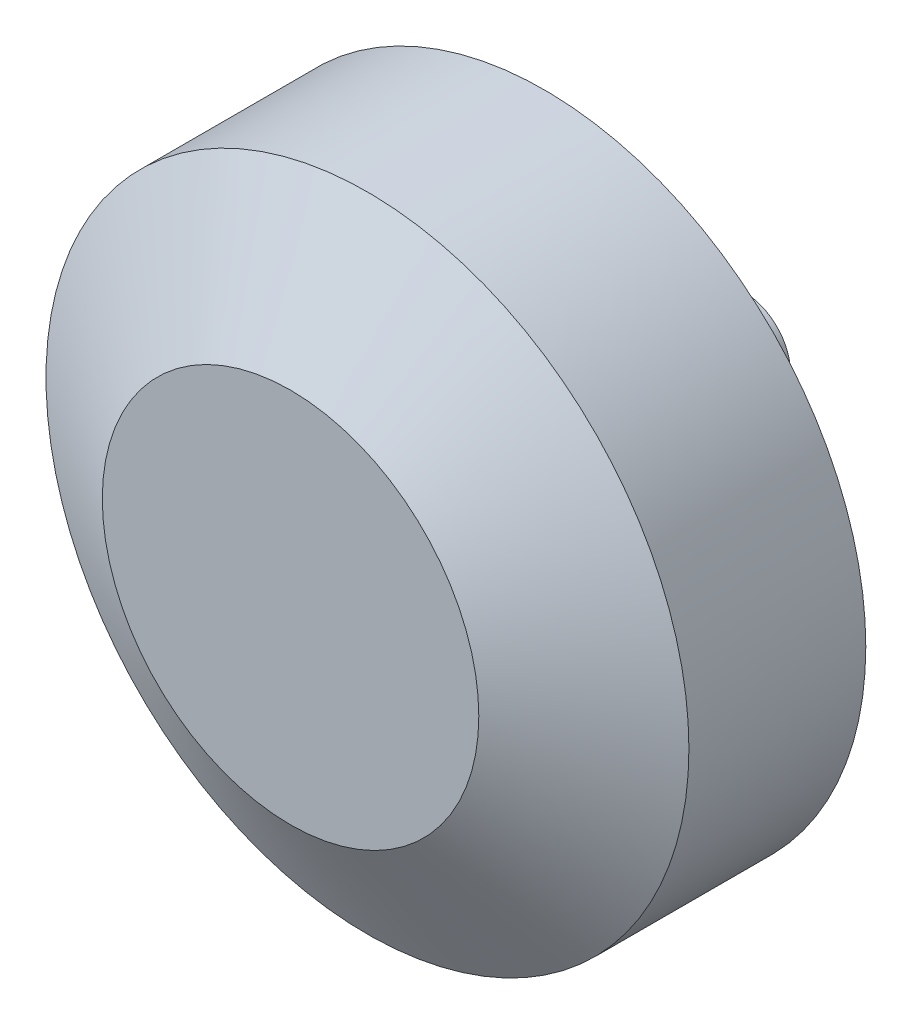
ISO-10303-21;
HEADER;
FILE_DESCRIPTION(('STEP AP214'),'2;1');
FILE_NAME('part.step','',(''),(''),'','','');
FILE_SCHEMA(('AUTOMOTIVE_DESIGN { 1 0 10303 214 1 1 1 1 }'));
ENDSEC;
DATA;
#1=APPLICATION_CONTEXT('core data for automotive mechanical design processes');
#2=APPLICATION_PROTOCOL_DEFINITION('international standard','automotive_design',2000,#1);
#3=PRODUCT_CONTEXT('',#1,'mechanical');
#4=PRODUCT('Part','Part','',(#3));
#5=PRODUCT_RELATED_PRODUCT_CATEGORY('part','',(#4));
#6=PRODUCT_DEFINITION_FORMATION('','',#4);
#7=PRODUCT_DEFINITION_CONTEXT('part definition',#1,'design');
#8=PRODUCT_DEFINITION('design','',#6,#7);
#9=PRODUCT_DEFINITION_SHAPE('','',#8);
#10=(LENGTH_UNIT() NAMED_UNIT(*) SI_UNIT(.MILLI.,.METRE.));
#11=(NAMED_UNIT(*) PLANE_ANGLE_UNIT() SI_UNIT($,.RADIAN.));
#12=(NAMED_UNIT(*) SI_UNIT($,.STERADIAN.) SOLID_ANGLE_UNIT());
#13=UNCERTAINTY_MEASURE_WITH_UNIT(LENGTH_MEASURE(1.E-05),#10,'distance_accuracy_value','');
#14=(GEOMETRIC_REPRESENTATION_CONTEXT(3) GLOBAL_UNCERTAINTY_ASSIGNED_CONTEXT((#13)) GLOBAL_UNIT_ASSIGNED_CONTEXT((#10,
#11,#12)) REPRESENTATION_CONTEXT('',''));
#15=CARTESIAN_POINT('',(0.,0.,0.));
#16=DIRECTION('',(0.,0.,1.));
#17=DIRECTION('',(1.,0.,0.));
#18=AXIS2_PLACEMENT_3D('',#15,#16,#17);
#19=CARTESIAN_POINT('',(0.,0.,10.75));
#20=DIRECTION('',(0.,0.,-1.));
#21=DIRECTION('',(-1.,0.,0.));
#22=AXIS2_PLACEMENT_3D('',#19,#20,#21);
#23=CYLINDRICAL_SURFACE('',#22,20.9);
#24=CARTESIAN_POINT('',(0.,0.,5.74999999999997));
#25=DIRECTION('',(0.,0.,1.));
#26=DIRECTION('',(1.,0.,0.));
#27=AXIS2_PLACEMENT_3D('',#24,#25,#26);
#28=CIRCLE('',#27,20.9);
#29=CARTESIAN_POINT('',(20.9,0.,5.74999999999997));
#30=VERTEX_POINT('',#29);
#31=EDGE_CURVE('E39',#30,#30,#28,.F.);
#32=ORIENTED_EDGE('',*,*,#31,.T.);
#33=EDGE_LOOP('',(#32));
#34=FACE_BOUND('',#33,.T.);
#35=CARTESIAN_POINT('',(0.,0.,-5.74999999999997));
#36=DIRECTION('',(0.,0.,1.));
#37=DIRECTION('',(1.,0.,0.));
#38=AXIS2_PLACEMENT_3D('',#35,#36,#37);
#39=CIRCLE('',#38,20.9);
#40=CARTESIAN_POINT('',(20.9,0.,-5.74999999999997));
#41=VERTEX_POINT('',#40);
#42=EDGE_CURVE('E43',#41,#41,#39,.T.);
#43=ORIENTED_EDGE('',*,*,#42,.T.);
#44=EDGE_LOOP('',(#43));
#45=FACE_BOUND('',#44,.T.);
#46=ADVANCED_FACE('F32',(#34,#45),#23,.T.);
#47=CARTESIAN_POINT('',(0.,0.,10.75));
#48=DIRECTION('',(0.,0.,1.));
#49=DIRECTION('',(1.,0.,0.));
#50=AXIS2_PLACEMENT_3D('',#47,#48,#49);
#51=PLANE('',#50);
#52=CARTESIAN_POINT('',(0.,0.,10.75));
#53=DIRECTION('',(0.,0.,1.));
#54=DIRECTION('',(1.,0.,0.));
#55=AXIS2_PLACEMENT_3D('',#52,#53,#54);
#56=CIRCLE('',#55,12.2397459621556);
#57=CARTESIAN_POINT('',(12.2397459621556,0.,10.75));
#58=VERTEX_POINT('',#57);
#59=EDGE_CURVE('E47',#58,#58,#56,.T.);
#60=ORIENTED_EDGE('',*,*,#59,.T.);
#61=EDGE_LOOP('',(#60));
#62=FACE_BOUND('',#61,.T.);
#63=ADVANCED_FACE('F69',(#62),#51,.T.);
#64=CARTESIAN_POINT('',(0.,0.,-10.75));
#65=DIRECTION('',(0.,0.,1.));
#66=DIRECTION('',(1.,0.,0.));
#67=AXIS2_PLACEMENT_3D('',#64,#65,#66);
#68=PLANE('',#67);
#69=CARTESIAN_POINT('',(0.,0.,-10.75));
#70=DIRECTION('',(0.,0.,1.));
#71=DIRECTION('',(1.,0.,0.));
#72=AXIS2_PLACEMENT_3D('',#69,#70,#71);
#73=CIRCLE('',#72,12.2397459621556);
#74=CARTESIAN_POINT('',(12.2397459621556,0.,-10.75));
#75=VERTEX_POINT('',#74);
#76=EDGE_CURVE('E10',#75,#75,#73,.F.);
#77=ORIENTED_EDGE('',*,*,#76,.T.);
#78=EDGE_LOOP('',(#77));
#79=FACE_BOUND('',#78,.T.);
#80=CARTESIAN_POINT('',(0.,0.,-10.75));
#81=DIRECTION('',(0.,0.,1.));
#82=DIRECTION('',(1.,0.,0.));
#83=AXIS2_PLACEMENT_3D('',#80,#81,#82);
#84=CIRCLE('',#83,3.);
#85=CARTESIAN_POINT('',(3.,0.,-10.75));
#86=VERTEX_POINT('',#85);
#87=EDGE_CURVE('E52',#86,#86,#84,.F.);
#88=ORIENTED_EDGE('',*,*,#87,.F.);
#89=EDGE_LOOP('',(#88));
#90=FACE_BOUND('',#89,.T.);
#91=ADVANCED_FACE('F64',(#79,#90),#68,.F.);
#92=CARTESIAN_POINT('',(0.,0.,-18.75));
#93=DIRECTION('',(0.,0.,1.));
#94=DIRECTION('',(1.,0.,0.));
#95=AXIS2_PLACEMENT_3D('',#92,#93,#94);
#96=CYLINDRICAL_SURFACE('',#95,3.);
#97=CARTESIAN_POINT('',(0.,0.,-18.75));
#98=DIRECTION('',(0.,0.,-1.));
#99=DIRECTION('',(-1.,0.,0.));
#100=AXIS2_PLACEMENT_3D('',#97,#98,#99);
#101=CIRCLE('',#100,3.);
#102=CARTESIAN_POINT('',(-3.,0.,-18.75));
#103=VERTEX_POINT('',#102);
#104=EDGE_CURVE('E55',#103,#103,#101,.T.);
#105=ORIENTED_EDGE('',*,*,#104,.F.);
#106=EDGE_LOOP('',(#105));
#107=FACE_BOUND('',#106,.T.);
#108=ORIENTED_EDGE('',*,*,#87,.T.);
#109=EDGE_LOOP('',(#108));
#110=FACE_BOUND('',#109,.T.);
#111=ADVANCED_FACE('F61',(#107,#110),#96,.T.);
#112=CARTESIAN_POINT('',(0.,0.,-18.75));
#113=DIRECTION('',(0.,0.,-1.));
#114=DIRECTION('',(-1.,0.,0.));
#115=AXIS2_PLACEMENT_3D('',#112,#113,#114);
#116=PLANE('',#115);
#117=ORIENTED_EDGE('',*,*,#104,.T.);
#118=EDGE_LOOP('',(#117));
#119=FACE_BOUND('',#118,.T.);
#120=ADVANCED_FACE('F59',(#119),#116,.T.);
#121=CARTESIAN_POINT('',(0.,0.,10.75));
#122=DIRECTION('',(0.,0.,-1.));
#123=DIRECTION('',(-1.,0.,0.));
#124=AXIS2_PLACEMENT_3D('',#121,#122,#123);
#125=CONICAL_SURFACE('',#124,12.2397459621556,1.0471975511966);
#126=ORIENTED_EDGE('',*,*,#31,.F.);
#127=EDGE_LOOP('',(#126));
#128=FACE_BOUND('',#127,.T.);
#129=ORIENTED_EDGE('',*,*,#59,.F.);
#130=EDGE_LOOP('',(#129));
#131=FACE_BOUND('',#130,.T.);
#132=ADVANCED_FACE('F81',(#128,#131),#125,.T.);
#133=CARTESIAN_POINT('',(0.,0.,-5.74999999999997));
#134=DIRECTION('',(0.,0.,1.));
#135=DIRECTION('',(1.,0.,0.));
#136=AXIS2_PLACEMENT_3D('',#133,#134,#135);
#137=CONICAL_SURFACE('',#136,20.9,1.0471975511966);
#138=ORIENTED_EDGE('',*,*,#76,.F.);
#139=EDGE_LOOP('',(#138));
#140=FACE_BOUND('',#139,.T.);
#141=ORIENTED_EDGE('',*,*,#42,.F.);
#142=EDGE_LOOP('',(#141));
#143=FACE_BOUND('',#142,.T.);
#144=ADVANCED_FACE('F34',(#140,#143),#137,.T.);
#145=CLOSED_SHELL('',(#46,#63,#91,#111,#120,#132,#144));
#146=MANIFOLD_SOLID_BREP('B2',#145);
#147=ADVANCED_BREP_SHAPE_REPRESENTATION('',(#18,#146),#14);
#148=SHAPE_DEFINITION_REPRESENTATION(#9,#147);
ENDSEC;
END-ISO-10303-21;
